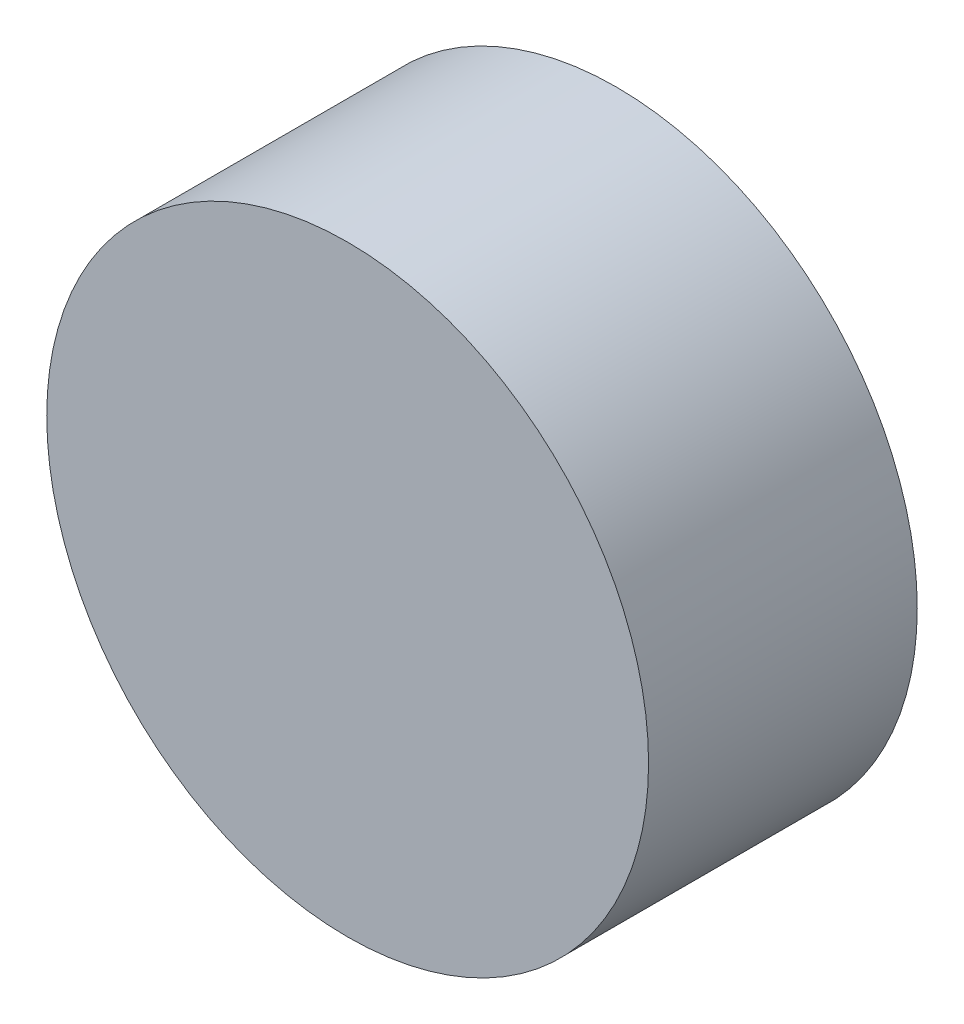
ISO-10303-21;
HEADER;
FILE_DESCRIPTION(('STEP AP214'),'2;1');
FILE_NAME('part.step','',(''),(''),'','','');
FILE_SCHEMA(('AUTOMOTIVE_DESIGN { 1 0 10303 214 1 1 1 1 }'));
ENDSEC;
DATA;
#1=APPLICATION_CONTEXT('core data for automotive mechanical design processes');
#2=APPLICATION_PROTOCOL_DEFINITION('international standard','automotive_design',2000,#1);
#3=PRODUCT_CONTEXT('',#1,'mechanical');
#4=PRODUCT('Part','Part','',(#3));
#5=PRODUCT_RELATED_PRODUCT_CATEGORY('part','',(#4));
#6=PRODUCT_DEFINITION_FORMATION('','',#4);
#7=PRODUCT_DEFINITION_CONTEXT('part definition',#1,'design');
#8=PRODUCT_DEFINITION('design','',#6,#7);
#9=PRODUCT_DEFINITION_SHAPE('','',#8);
#10=(LENGTH_UNIT() NAMED_UNIT(*) SI_UNIT(.MILLI.,.METRE.));
#11=(NAMED_UNIT(*) PLANE_ANGLE_UNIT() SI_UNIT($,.RADIAN.));
#12=(NAMED_UNIT(*) SI_UNIT($,.STERADIAN.) SOLID_ANGLE_UNIT());
#13=UNCERTAINTY_MEASURE_WITH_UNIT(LENGTH_MEASURE(1.E-05),#10,'distance_accuracy_value','');
#14=(GEOMETRIC_REPRESENTATION_CONTEXT(3) GLOBAL_UNCERTAINTY_ASSIGNED_CONTEXT((#13)) GLOBAL_UNIT_ASSIGNED_CONTEXT((#10,
#11,#12)) REPRESENTATION_CONTEXT('',''));
#15=CARTESIAN_POINT('',(0.,0.,0.));
#16=DIRECTION('',(0.,0.,1.));
#17=DIRECTION('',(1.,0.,0.));
#18=AXIS2_PLACEMENT_3D('',#15,#16,#17);
#19=CARTESIAN_POINT('',(0.,0.,5.));
#20=DIRECTION('',(0.,0.,-1.));
#21=DIRECTION('',(-1.,0.,0.));
#22=AXIS2_PLACEMENT_3D('',#19,#20,#21);
#23=CYLINDRICAL_SURFACE('',#22,5.6);
#24=CARTESIAN_POINT('',(0.,0.,5.));
#25=DIRECTION('',(0.,0.,1.));
#26=DIRECTION('',(1.,0.,0.));
#27=AXIS2_PLACEMENT_3D('',#24,#25,#26);
#28=CIRCLE('',#27,5.6);
#29=CARTESIAN_POINT('',(5.6,0.,5.));
#30=VERTEX_POINT('',#29);
#31=EDGE_CURVE('E10',#30,#30,#28,.T.);
#32=ORIENTED_EDGE('',*,*,#31,.F.);
#33=EDGE_LOOP('',(#32));
#34=FACE_BOUND('',#33,.T.);
#35=CARTESIAN_POINT('',(0.,0.,0.));
#36=DIRECTION('',(0.,0.,1.));
#37=DIRECTION('',(1.,0.,0.));
#38=AXIS2_PLACEMENT_3D('',#35,#36,#37);
#39=CIRCLE('',#38,5.6);
#40=CARTESIAN_POINT('',(5.6,0.,0.));
#41=VERTEX_POINT('',#40);
#42=EDGE_CURVE('E40',#41,#41,#39,.T.);
#43=ORIENTED_EDGE('',*,*,#42,.T.);
#44=EDGE_LOOP('',(#43));
#45=FACE_BOUND('',#44,.T.);
#46=ADVANCED_FACE('F37',(#34,#45),#23,.T.);
#47=CARTESIAN_POINT('',(0.,0.,5.));
#48=DIRECTION('',(0.,0.,1.));
#49=DIRECTION('',(1.,0.,0.));
#50=AXIS2_PLACEMENT_3D('',#47,#48,#49);
#51=PLANE('',#50);
#52=ORIENTED_EDGE('',*,*,#31,.T.);
#53=EDGE_LOOP('',(#52));
#54=FACE_BOUND('',#53,.T.);
#55=ADVANCED_FACE('F54',(#54),#51,.T.);
#56=CARTESIAN_POINT('',(0.,0.,0.));
#57=DIRECTION('',(0.,0.,1.));
#58=DIRECTION('',(1.,0.,0.));
#59=AXIS2_PLACEMENT_3D('',#56,#57,#58);
#60=PLANE('',#59);
#61=ORIENTED_EDGE('',*,*,#42,.F.);
#62=EDGE_LOOP('',(#61));
#63=FACE_BOUND('',#62,.T.);
#64=ADVANCED_FACE('F52',(#63),#60,.F.);
#65=CLOSED_SHELL('',(#46,#55,#64));
#66=MANIFOLD_SOLID_BREP('B2',#65);
#67=ADVANCED_BREP_SHAPE_REPRESENTATION('',(#18,#66),#14);
#68=SHAPE_DEFINITION_REPRESENTATION(#9,#67);
ENDSEC;
END-ISO-10303-21;
